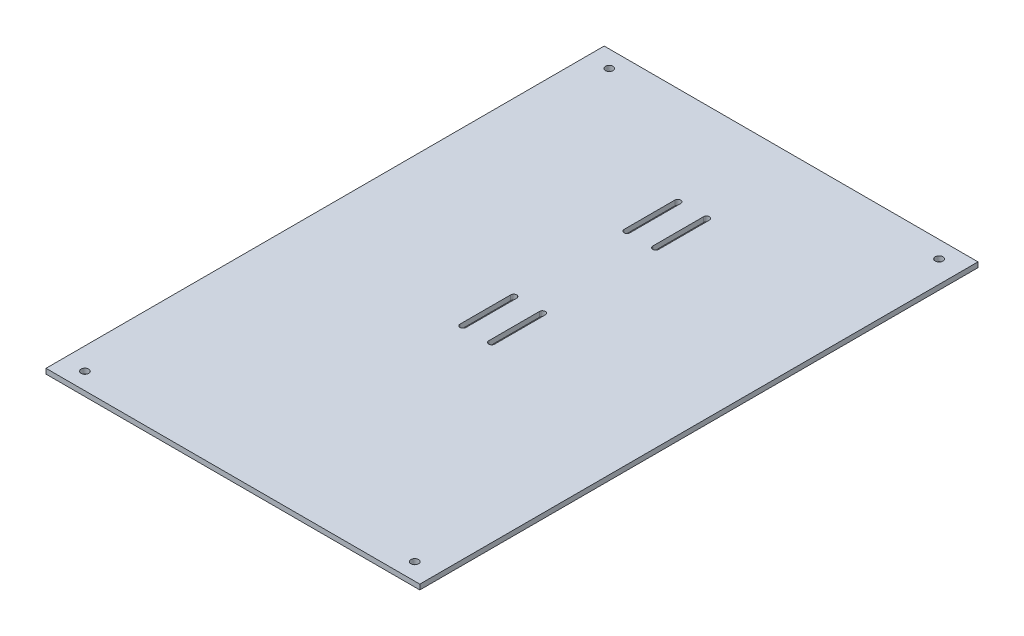
ISO-10303-21;
HEADER;
FILE_DESCRIPTION(('STEP AP214'),'2;1');
FILE_NAME('part.step','',(''),(''),'','','');
FILE_SCHEMA(('AUTOMOTIVE_DESIGN { 1 0 10303 214 1 1 1 1 }'));
ENDSEC;
DATA;
#1=APPLICATION_CONTEXT('core data for automotive mechanical design processes');
#2=APPLICATION_PROTOCOL_DEFINITION('international standard','automotive_design',2000,#1);
#3=PRODUCT_CONTEXT('',#1,'mechanical');
#4=PRODUCT('Part','Part','',(#3));
#5=PRODUCT_RELATED_PRODUCT_CATEGORY('part','',(#4));
#6=PRODUCT_DEFINITION_FORMATION('','',#4);
#7=PRODUCT_DEFINITION_CONTEXT('part definition',#1,'design');
#8=PRODUCT_DEFINITION('design','',#6,#7);
#9=PRODUCT_DEFINITION_SHAPE('','',#8);
#10=(LENGTH_UNIT() NAMED_UNIT(*) SI_UNIT(.MILLI.,.METRE.));
#11=(NAMED_UNIT(*) PLANE_ANGLE_UNIT() SI_UNIT($,.RADIAN.));
#12=(NAMED_UNIT(*) SI_UNIT($,.STERADIAN.) SOLID_ANGLE_UNIT());
#13=UNCERTAINTY_MEASURE_WITH_UNIT(LENGTH_MEASURE(1.E-05),#10,'distance_accuracy_value','');
#14=(GEOMETRIC_REPRESENTATION_CONTEXT(3) GLOBAL_UNCERTAINTY_ASSIGNED_CONTEXT((#13)) GLOBAL_UNIT_ASSIGNED_CONTEXT((#10,
#11,#12)) REPRESENTATION_CONTEXT('',''));
#15=CARTESIAN_POINT('',(0.,0.,0.));
#16=DIRECTION('',(0.,0.,1.));
#17=DIRECTION('',(1.,0.,0.));
#18=AXIS2_PLACEMENT_3D('',#15,#16,#17);
#19=CARTESIAN_POINT('',(110.5,-13.,207.5));
#20=DIRECTION('',(0.,1.,0.));
#21=DIRECTION('',(0.,0.,1.));
#22=AXIS2_PLACEMENT_3D('',#19,#20,#21);
#23=PLANE('',#22);
#24=CARTESIAN_POINT('',(-97.5,-13.,197.5));
#25=DIRECTION('',(0.,-1.,0.));
#26=DIRECTION('',(0.,0.,-1.));
#27=AXIS2_PLACEMENT_3D('',#24,#25,#26);
#28=CIRCLE('',#27,2.24999999999999);
#29=CARTESIAN_POINT('',(-97.5,-13.,195.25));
#30=VERTEX_POINT('',#29);
#31=EDGE_CURVE('E374',#30,#30,#28,.T.);
#32=ORIENTED_EDGE('',*,*,#31,.F.);
#33=EDGE_LOOP('',(#32));
#34=FACE_BOUND('',#33,.T.);
#35=CARTESIAN_POINT('',(97.5,-13.,197.5));
#36=DIRECTION('',(0.,-1.,0.));
#37=DIRECTION('',(0.,0.,-1.));
#38=AXIS2_PLACEMENT_3D('',#35,#36,#37);
#39=CIRCLE('',#38,2.24999999999999);
#40=CARTESIAN_POINT('',(97.5,-13.,195.25));
#41=VERTEX_POINT('',#40);
#42=EDGE_CURVE('E378',#41,#41,#39,.T.);
#43=ORIENTED_EDGE('',*,*,#42,.F.);
#44=EDGE_LOOP('',(#43));
#45=FACE_BOUND('',#44,.T.);
#46=CARTESIAN_POINT('',(97.5,-13.,-112.5));
#47=DIRECTION('',(0.,-1.,0.));
#48=DIRECTION('',(0.,0.,-1.));
#49=AXIS2_PLACEMENT_3D('',#46,#47,#48);
#50=CIRCLE('',#49,2.24999999999999);
#51=CARTESIAN_POINT('',(97.5,-13.,-114.75));
#52=VERTEX_POINT('',#51);
#53=EDGE_CURVE('E382',#52,#52,#50,.T.);
#54=ORIENTED_EDGE('',*,*,#53,.F.);
#55=EDGE_LOOP('',(#54));
#56=FACE_BOUND('',#55,.T.);
#57=CARTESIAN_POINT('',(-97.5,-13.,-112.5));
#58=DIRECTION('',(0.,-1.,0.));
#59=DIRECTION('',(0.,0.,-1.));
#60=AXIS2_PLACEMENT_3D('',#57,#58,#59);
#61=CIRCLE('',#60,2.24999999999999);
#62=CARTESIAN_POINT('',(-97.5,-13.,-114.75));
#63=VERTEX_POINT('',#62);
#64=EDGE_CURVE('E386',#63,#63,#61,.T.);
#65=ORIENTED_EDGE('',*,*,#64,.F.);
#66=EDGE_LOOP('',(#65));
#67=FACE_BOUND('',#66,.T.);
#68=DIRECTION('',(0.,0.,-1.));
#69=VECTOR('',#68,1.);
#70=CARTESIAN_POINT('',(-10.7431705127637,-13.,62.5));
#71=LINE('',#70,#69);
#72=CARTESIAN_POINT('',(-10.7431705127637,-13.,62.5));
#73=VERTEX_POINT('',#72);
#74=CARTESIAN_POINT('',(-10.7431705127637,-13.,32.5));
#75=VERTEX_POINT('',#74);
#76=EDGE_CURVE('E201',#73,#75,#71,.T.);
#77=ORIENTED_EDGE('',*,*,#76,.F.);
#78=CARTESIAN_POINT('',(-8.9931705127637,-13.,62.5));
#79=DIRECTION('',(0.,-1.,0.));
#80=DIRECTION('',(0.,0.,-1.));
#81=AXIS2_PLACEMENT_3D('',#78,#79,#80);
#82=CIRCLE('',#81,1.75);
#83=CARTESIAN_POINT('',(-7.2431705127637,-13.,62.5));
#84=VERTEX_POINT('',#83);
#85=EDGE_CURVE('E56',#84,#73,#82,.T.);
#86=ORIENTED_EDGE('',*,*,#85,.F.);
#87=DIRECTION('',(0.,0.,1.));
#88=VECTOR('',#87,1.);
#89=CARTESIAN_POINT('',(-7.2431705127637,-13.,62.5));
#90=LINE('',#89,#88);
#91=CARTESIAN_POINT('',(-7.2431705127637,-13.,32.5));
#92=VERTEX_POINT('',#91);
#93=EDGE_CURVE('E194',#92,#84,#90,.T.);
#94=ORIENTED_EDGE('',*,*,#93,.F.);
#95=CARTESIAN_POINT('',(-8.9931705127637,-13.,32.5));
#96=DIRECTION('',(0.,-1.,0.));
#97=DIRECTION('',(0.,0.,-1.));
#98=AXIS2_PLACEMENT_3D('',#95,#96,#97);
#99=CIRCLE('',#98,1.75);
#100=EDGE_CURVE('E208',#75,#92,#99,.T.);
#101=ORIENTED_EDGE('',*,*,#100,.F.);
#102=EDGE_LOOP('',(#77,#86,#94,#101));
#103=FACE_BOUND('',#102,.T.);
#104=DIRECTION('',(0.,0.,-1.));
#105=VECTOR('',#104,1.);
#106=CARTESIAN_POINT('',(6.25682948723529,-13.,62.4999999999998));
#107=LINE('',#106,#105);
#108=CARTESIAN_POINT('',(6.25682948723529,-13.,62.4999999999998));
#109=VERTEX_POINT('',#108);
#110=CARTESIAN_POINT('',(6.25682948723529,-13.,32.4999999999998));
#111=VERTEX_POINT('',#110);
#112=EDGE_CURVE('E260',#109,#111,#107,.T.);
#113=ORIENTED_EDGE('',*,*,#112,.F.);
#114=CARTESIAN_POINT('',(8.00682948723529,-13.,62.4999999999998));
#115=DIRECTION('',(0.,-1.,0.));
#116=DIRECTION('',(0.,0.,-1.));
#117=AXIS2_PLACEMENT_3D('',#114,#115,#116);
#118=CIRCLE('',#117,1.74999999999999);
#119=CARTESIAN_POINT('',(9.75682948723527,-13.,62.4999999999998));
#120=VERTEX_POINT('',#119);
#121=EDGE_CURVE('E64',#120,#109,#118,.T.);
#122=ORIENTED_EDGE('',*,*,#121,.F.);
#123=DIRECTION('',(0.,0.,1.));
#124=VECTOR('',#123,1.);
#125=CARTESIAN_POINT('',(9.75682948723527,-13.,62.4999999999998));
#126=LINE('',#125,#124);
#127=CARTESIAN_POINT('',(9.75682948723527,-13.,32.4999999999998));
#128=VERTEX_POINT('',#127);
#129=EDGE_CURVE('E266',#128,#120,#126,.T.);
#130=ORIENTED_EDGE('',*,*,#129,.F.);
#131=CARTESIAN_POINT('',(8.00682948723529,-13.,32.4999999999998));
#132=DIRECTION('',(0.,-1.,0.));
#133=DIRECTION('',(0.,0.,-1.));
#134=AXIS2_PLACEMENT_3D('',#131,#132,#133);
#135=CIRCLE('',#134,1.74999999999999);
#136=EDGE_CURVE('E263',#111,#128,#135,.T.);
#137=ORIENTED_EDGE('',*,*,#136,.F.);
#138=EDGE_LOOP('',(#113,#122,#130,#137));
#139=FACE_BOUND('',#138,.T.);
#140=DIRECTION('',(0.,0.,-1.));
#141=VECTOR('',#140,1.);
#142=CARTESIAN_POINT('',(6.25682948723529,-13.,-34.5000000000001));
#143=LINE('',#142,#141);
#144=CARTESIAN_POINT('',(6.25682948723529,-13.,-34.5000000000001));
#145=VERTEX_POINT('',#144);
#146=CARTESIAN_POINT('',(6.2568294872353,-13.,-64.5000000000001));
#147=VERTEX_POINT('',#146);
#148=EDGE_CURVE('E229',#145,#147,#143,.T.);
#149=ORIENTED_EDGE('',*,*,#148,.F.);
#150=CARTESIAN_POINT('',(8.00682948723529,-13.,-34.5000000000001));
#151=DIRECTION('',(0.,-1.,0.));
#152=DIRECTION('',(0.,0.,-1.));
#153=AXIS2_PLACEMENT_3D('',#150,#151,#152);
#154=CIRCLE('',#153,1.75);
#155=CARTESIAN_POINT('',(9.75682948723529,-13.,-34.5000000000001));
#156=VERTEX_POINT('',#155);
#157=EDGE_CURVE('E227',#156,#145,#154,.T.);
#158=ORIENTED_EDGE('',*,*,#157,.F.);
#159=DIRECTION('',(0.,0.,1.));
#160=VECTOR('',#159,1.);
#161=CARTESIAN_POINT('',(9.75682948723529,-13.,-34.5000000000001));
#162=LINE('',#161,#160);
#163=CARTESIAN_POINT('',(9.75682948723529,-13.,-64.5000000000001));
#164=VERTEX_POINT('',#163);
#165=EDGE_CURVE('E235',#164,#156,#162,.T.);
#166=ORIENTED_EDGE('',*,*,#165,.F.);
#167=CARTESIAN_POINT('',(8.0068294872353,-13.,-64.5000000000001));
#168=DIRECTION('',(0.,-1.,0.));
#169=DIRECTION('',(0.,0.,-1.));
#170=AXIS2_PLACEMENT_3D('',#167,#168,#169);
#171=CIRCLE('',#170,1.75);
#172=EDGE_CURVE('E232',#147,#164,#171,.T.);
#173=ORIENTED_EDGE('',*,*,#172,.F.);
#174=EDGE_LOOP('',(#149,#158,#166,#173));
#175=FACE_BOUND('',#174,.T.);
#176=DIRECTION('',(0.,0.,-1.));
#177=VECTOR('',#176,1.);
#178=CARTESIAN_POINT('',(-10.7431705127637,-13.,-34.4999999999999));
#179=LINE('',#178,#177);
#180=CARTESIAN_POINT('',(-10.7431705127637,-13.,-34.5));
#181=VERTEX_POINT('',#180);
#182=CARTESIAN_POINT('',(-10.7431705127637,-13.,-64.4999999999999));
#183=VERTEX_POINT('',#182);
#184=EDGE_CURVE('E289',#181,#183,#179,.T.);
#185=ORIENTED_EDGE('',*,*,#184,.F.);
#186=CARTESIAN_POINT('',(-8.9931705127637,-13.,-34.4999999999999));
#187=DIRECTION('',(0.,-1.,0.));
#188=DIRECTION('',(0.,0.,-1.));
#189=AXIS2_PLACEMENT_3D('',#186,#187,#188);
#190=CIRCLE('',#189,1.75);
#191=CARTESIAN_POINT('',(-7.2431705127637,-13.,-34.4999999999999));
#192=VERTEX_POINT('',#191);
#193=EDGE_CURVE('E287',#192,#181,#190,.T.);
#194=ORIENTED_EDGE('',*,*,#193,.F.);
#195=DIRECTION('',(0.,0.,1.));
#196=VECTOR('',#195,1.);
#197=CARTESIAN_POINT('',(-7.2431705127637,-13.,-34.4999999999999));
#198=LINE('',#197,#196);
#199=CARTESIAN_POINT('',(-7.2431705127637,-13.,-64.4999999999999));
#200=VERTEX_POINT('',#199);
#201=EDGE_CURVE('E295',#200,#192,#198,.T.);
#202=ORIENTED_EDGE('',*,*,#201,.F.);
#203=CARTESIAN_POINT('',(-8.9931705127637,-13.,-64.4999999999999));
#204=DIRECTION('',(0.,-1.,0.));
#205=DIRECTION('',(0.,0.,-1.));
#206=AXIS2_PLACEMENT_3D('',#203,#204,#205);
#207=CIRCLE('',#206,1.75);
#208=EDGE_CURVE('E292',#183,#200,#207,.T.);
#209=ORIENTED_EDGE('',*,*,#208,.F.);
#210=EDGE_LOOP('',(#185,#194,#202,#209));
#211=FACE_BOUND('',#210,.T.);
#212=DIRECTION('',(-1.,0.,0.));
#213=VECTOR('',#212,1.);
#214=CARTESIAN_POINT('',(110.5,-13.,207.5));
#215=LINE('',#214,#213);
#216=CARTESIAN_POINT('',(110.5,-13.,207.5));
#217=VERTEX_POINT('',#216);
#218=CARTESIAN_POINT('',(-110.5,-13.,207.5));
#219=VERTEX_POINT('',#218);
#220=EDGE_CURVE('E333',#217,#219,#215,.T.);
#221=ORIENTED_EDGE('',*,*,#220,.T.);
#222=DIRECTION('',(0.,0.,-1.));
#223=VECTOR('',#222,1.);
#224=CARTESIAN_POINT('',(-110.5,-13.,207.5));
#225=LINE('',#224,#223);
#226=CARTESIAN_POINT('',(-110.5,-13.,-122.5));
#227=VERTEX_POINT('',#226);
#228=EDGE_CURVE('E310',#219,#227,#225,.T.);
#229=ORIENTED_EDGE('',*,*,#228,.T.);
#230=DIRECTION('',(-1.,0.,0.));
#231=VECTOR('',#230,1.);
#232=CARTESIAN_POINT('',(110.5,-13.,-122.5));
#233=LINE('',#232,#231);
#234=CARTESIAN_POINT('',(110.5,-13.,-122.5));
#235=VERTEX_POINT('',#234);
#236=EDGE_CURVE('E11',#235,#227,#233,.T.);
#237=ORIENTED_EDGE('',*,*,#236,.F.);
#238=DIRECTION('',(0.,0.,-1.));
#239=VECTOR('',#238,1.);
#240=CARTESIAN_POINT('',(110.5,-13.,207.5));
#241=LINE('',#240,#239);
#242=EDGE_CURVE('E322',#217,#235,#241,.T.);
#243=ORIENTED_EDGE('',*,*,#242,.F.);
#244=EDGE_LOOP('',(#221,#229,#237,#243));
#245=FACE_BOUND('',#244,.T.);
#246=ADVANCED_FACE('F42',(#34,#45,#56,#67,#103,#139,#175,#211,#245),#23,.F.);
#247=CARTESIAN_POINT('',(110.5,-10.,-122.5));
#248=DIRECTION('',(0.,0.,-1.));
#249=DIRECTION('',(0.,1.,0.));
#250=AXIS2_PLACEMENT_3D('',#247,#248,#249);
#251=PLANE('',#250);
#252=ORIENTED_EDGE('',*,*,#236,.T.);
#253=DIRECTION('',(0.,-1.,0.));
#254=VECTOR('',#253,1.);
#255=CARTESIAN_POINT('',(-110.5,-10.,-122.5));
#256=LINE('',#255,#254);
#257=CARTESIAN_POINT('',(-110.5,-10.,-122.5));
#258=VERTEX_POINT('',#257);
#259=EDGE_CURVE('E313',#258,#227,#256,.T.);
#260=ORIENTED_EDGE('',*,*,#259,.F.);
#261=DIRECTION('',(-1.,0.,0.));
#262=VECTOR('',#261,1.);
#263=CARTESIAN_POINT('',(110.5,-10.,-122.5));
#264=LINE('',#263,#262);
#265=CARTESIAN_POINT('',(110.5,-10.,-122.5));
#266=VERTEX_POINT('',#265);
#267=EDGE_CURVE('E49',#266,#258,#264,.T.);
#268=ORIENTED_EDGE('',*,*,#267,.F.);
#269=DIRECTION('',(0.,-1.,0.));
#270=VECTOR('',#269,1.);
#271=CARTESIAN_POINT('',(110.5,-10.,-122.5));
#272=LINE('',#271,#270);
#273=EDGE_CURVE('E324',#266,#235,#272,.T.);
#274=ORIENTED_EDGE('',*,*,#273,.T.);
#275=EDGE_LOOP('',(#252,#260,#268,#274));
#276=FACE_BOUND('',#275,.T.);
#277=ADVANCED_FACE('F346',(#276),#251,.T.);
#278=CARTESIAN_POINT('',(110.5,-10.,207.5));
#279=DIRECTION('',(0.,1.,0.));
#280=DIRECTION('',(0.,0.,1.));
#281=AXIS2_PLACEMENT_3D('',#278,#279,#280);
#282=PLANE('',#281);
#283=CARTESIAN_POINT('',(-97.5,-10.,197.5));
#284=DIRECTION('',(0.,-1.,0.));
#285=DIRECTION('',(0.,0.,-1.));
#286=AXIS2_PLACEMENT_3D('',#283,#284,#285);
#287=CIRCLE('',#286,2.25);
#288=CARTESIAN_POINT('',(-97.5,-10.,195.25));
#289=VERTEX_POINT('',#288);
#290=EDGE_CURVE('E675',#289,#289,#287,.T.);
#291=ORIENTED_EDGE('',*,*,#290,.T.);
#292=EDGE_LOOP('',(#291));
#293=FACE_BOUND('',#292,.T.);
#294=CARTESIAN_POINT('',(97.5,-10.,197.5));
#295=DIRECTION('',(0.,-1.,0.));
#296=DIRECTION('',(0.,0.,-1.));
#297=AXIS2_PLACEMENT_3D('',#294,#295,#296);
#298=CIRCLE('',#297,2.25);
#299=CARTESIAN_POINT('',(97.5,-10.,195.25));
#300=VERTEX_POINT('',#299);
#301=EDGE_CURVE('E679',#300,#300,#298,.T.);
#302=ORIENTED_EDGE('',*,*,#301,.T.);
#303=EDGE_LOOP('',(#302));
#304=FACE_BOUND('',#303,.T.);
#305=CARTESIAN_POINT('',(97.5,-10.,-112.5));
#306=DIRECTION('',(0.,-1.,0.));
#307=DIRECTION('',(0.,0.,-1.));
#308=AXIS2_PLACEMENT_3D('',#305,#306,#307);
#309=CIRCLE('',#308,2.25);
#310=CARTESIAN_POINT('',(97.5,-10.,-114.75));
#311=VERTEX_POINT('',#310);
#312=EDGE_CURVE('E683',#311,#311,#309,.T.);
#313=ORIENTED_EDGE('',*,*,#312,.T.);
#314=EDGE_LOOP('',(#313));
#315=FACE_BOUND('',#314,.T.);
#316=CARTESIAN_POINT('',(-97.5,-10.,-112.5));
#317=DIRECTION('',(0.,-1.,0.));
#318=DIRECTION('',(0.,0.,-1.));
#319=AXIS2_PLACEMENT_3D('',#316,#317,#318);
#320=CIRCLE('',#319,2.25);
#321=CARTESIAN_POINT('',(-97.5,-10.,-114.75));
#322=VERTEX_POINT('',#321);
#323=EDGE_CURVE('E686',#322,#322,#320,.T.);
#324=ORIENTED_EDGE('',*,*,#323,.T.);
#325=EDGE_LOOP('',(#324));
#326=FACE_BOUND('',#325,.T.);
#327=CARTESIAN_POINT('',(-8.9931705127637,-10.,62.5));
#328=DIRECTION('',(0.,1.,0.));
#329=DIRECTION('',(0.,0.,1.));
#330=AXIS2_PLACEMENT_3D('',#327,#328,#329);
#331=CIRCLE('',#330,1.75);
#332=CARTESIAN_POINT('',(-7.2431705127637,-10.,62.5));
#333=VERTEX_POINT('',#332);
#334=CARTESIAN_POINT('',(-10.7431705127637,-10.,62.5));
#335=VERTEX_POINT('',#334);
#336=EDGE_CURVE('E192',#333,#335,#331,.F.);
#337=ORIENTED_EDGE('',*,*,#336,.T.);
#338=DIRECTION('',(0.,0.,-1.));
#339=VECTOR('',#338,1.);
#340=CARTESIAN_POINT('',(-10.7431705127637,-10.,62.5));
#341=LINE('',#340,#339);
#342=CARTESIAN_POINT('',(-10.7431705127637,-10.,32.5));
#343=VERTEX_POINT('',#342);
#344=EDGE_CURVE('E178',#335,#343,#341,.T.);
#345=ORIENTED_EDGE('',*,*,#344,.T.);
#346=CARTESIAN_POINT('',(-8.9931705127637,-10.,32.5));
#347=DIRECTION('',(0.,1.,0.));
#348=DIRECTION('',(0.,0.,1.));
#349=AXIS2_PLACEMENT_3D('',#346,#347,#348);
#350=CIRCLE('',#349,1.75);
#351=CARTESIAN_POINT('',(-7.2431705127637,-10.,32.5));
#352=VERTEX_POINT('',#351);
#353=EDGE_CURVE('E203',#343,#352,#350,.F.);
#354=ORIENTED_EDGE('',*,*,#353,.T.);
#355=DIRECTION('',(0.,0.,1.));
#356=VECTOR('',#355,1.);
#357=CARTESIAN_POINT('',(-7.2431705127637,-10.,62.5));
#358=LINE('',#357,#356);
#359=EDGE_CURVE('E199',#352,#333,#358,.T.);
#360=ORIENTED_EDGE('',*,*,#359,.T.);
#361=EDGE_LOOP('',(#337,#345,#354,#360));
#362=FACE_BOUND('',#361,.T.);
#363=CARTESIAN_POINT('',(8.00682948723529,-10.,62.4999999999998));
#364=DIRECTION('',(0.,1.,0.));
#365=DIRECTION('',(0.,0.,1.));
#366=AXIS2_PLACEMENT_3D('',#363,#364,#365);
#367=CIRCLE('',#366,1.74999999999999);
#368=CARTESIAN_POINT('',(9.75682948723527,-10.,62.4999999999998));
#369=VERTEX_POINT('',#368);
#370=CARTESIAN_POINT('',(6.25682948723529,-10.,62.4999999999998));
#371=VERTEX_POINT('',#370);
#372=EDGE_CURVE('E256',#369,#371,#367,.F.);
#373=ORIENTED_EDGE('',*,*,#372,.T.);
#374=DIRECTION('',(0.,0.,-1.));
#375=VECTOR('',#374,1.);
#376=CARTESIAN_POINT('',(6.25682948723529,-10.,62.4999999999998));
#377=LINE('',#376,#375);
#378=CARTESIAN_POINT('',(6.25682948723529,-10.,32.4999999999998));
#379=VERTEX_POINT('',#378);
#380=EDGE_CURVE('E221',#371,#379,#377,.T.);
#381=ORIENTED_EDGE('',*,*,#380,.T.);
#382=CARTESIAN_POINT('',(8.00682948723529,-10.,32.4999999999998));
#383=DIRECTION('',(0.,1.,0.));
#384=DIRECTION('',(0.,0.,1.));
#385=AXIS2_PLACEMENT_3D('',#382,#383,#384);
#386=CIRCLE('',#385,1.74999999999999);
#387=CARTESIAN_POINT('',(9.75682948723528,-10.,32.4999999999998));
#388=VERTEX_POINT('',#387);
#389=EDGE_CURVE('E188',#379,#388,#386,.F.);
#390=ORIENTED_EDGE('',*,*,#389,.T.);
#391=DIRECTION('',(0.,0.,1.));
#392=VECTOR('',#391,1.);
#393=CARTESIAN_POINT('',(9.75682948723527,-10.,62.4999999999998));
#394=LINE('',#393,#392);
#395=EDGE_CURVE('E253',#388,#369,#394,.T.);
#396=ORIENTED_EDGE('',*,*,#395,.T.);
#397=EDGE_LOOP('',(#373,#381,#390,#396));
#398=FACE_BOUND('',#397,.T.);
#399=CARTESIAN_POINT('',(8.00682948723529,-10.,-34.5000000000001));
#400=DIRECTION('',(0.,1.,0.));
#401=DIRECTION('',(0.,0.,1.));
#402=AXIS2_PLACEMENT_3D('',#399,#400,#401);
#403=CIRCLE('',#402,1.75);
#404=CARTESIAN_POINT('',(9.75682948723529,-10.,-34.5000000000001));
#405=VERTEX_POINT('',#404);
#406=CARTESIAN_POINT('',(6.25682948723529,-10.,-34.5000000000001));
#407=VERTEX_POINT('',#406);
#408=EDGE_CURVE('E224',#405,#407,#403,.F.);
#409=ORIENTED_EDGE('',*,*,#408,.T.);
#410=DIRECTION('',(0.,0.,-1.));
#411=VECTOR('',#410,1.);
#412=CARTESIAN_POINT('',(6.25682948723529,-10.,-34.5000000000001));
#413=LINE('',#412,#411);
#414=CARTESIAN_POINT('',(6.25682948723528,-10.,-64.5000000000001));
#415=VERTEX_POINT('',#414);
#416=EDGE_CURVE('E241',#407,#415,#413,.T.);
#417=ORIENTED_EDGE('',*,*,#416,.T.);
#418=CARTESIAN_POINT('',(8.0068294872353,-10.,-64.5000000000001));
#419=DIRECTION('',(0.,1.,0.));
#420=DIRECTION('',(0.,0.,1.));
#421=AXIS2_PLACEMENT_3D('',#418,#419,#420);
#422=CIRCLE('',#421,1.75);
#423=CARTESIAN_POINT('',(9.7568294872353,-10.,-64.5000000000001));
#424=VERTEX_POINT('',#423);
#425=EDGE_CURVE('E217',#415,#424,#422,.F.);
#426=ORIENTED_EDGE('',*,*,#425,.T.);
#427=DIRECTION('',(0.,0.,1.));
#428=VECTOR('',#427,1.);
#429=CARTESIAN_POINT('',(9.75682948723529,-10.,-34.5000000000001));
#430=LINE('',#429,#428);
#431=EDGE_CURVE('E220',#424,#405,#430,.T.);
#432=ORIENTED_EDGE('',*,*,#431,.T.);
#433=EDGE_LOOP('',(#409,#417,#426,#432));
#434=FACE_BOUND('',#433,.T.);
#435=CARTESIAN_POINT('',(-8.9931705127637,-10.,-34.4999999999999));
#436=DIRECTION('',(0.,1.,0.));
#437=DIRECTION('',(0.,0.,1.));
#438=AXIS2_PLACEMENT_3D('',#435,#436,#437);
#439=CIRCLE('',#438,1.75);
#440=CARTESIAN_POINT('',(-7.2431705127637,-10.,-34.4999999999999));
#441=VERTEX_POINT('',#440);
#442=CARTESIAN_POINT('',(-10.7431705127637,-10.,-34.4999999999999));
#443=VERTEX_POINT('',#442);
#444=EDGE_CURVE('E284',#441,#443,#439,.F.);
#445=ORIENTED_EDGE('',*,*,#444,.T.);
#446=DIRECTION('',(0.,0.,-1.));
#447=VECTOR('',#446,1.);
#448=CARTESIAN_POINT('',(-10.7431705127637,-10.,-34.4999999999999));
#449=LINE('',#448,#447);
#450=CARTESIAN_POINT('',(-10.7431705127637,-10.,-64.5));
#451=VERTEX_POINT('',#450);
#452=EDGE_CURVE('E301',#443,#451,#449,.T.);
#453=ORIENTED_EDGE('',*,*,#452,.T.);
#454=CARTESIAN_POINT('',(-8.9931705127637,-10.,-64.4999999999999));
#455=DIRECTION('',(0.,1.,0.));
#456=DIRECTION('',(0.,0.,1.));
#457=AXIS2_PLACEMENT_3D('',#454,#455,#456);
#458=CIRCLE('',#457,1.75);
#459=CARTESIAN_POINT('',(-7.2431705127637,-10.,-64.4999999999999));
#460=VERTEX_POINT('',#459);
#461=EDGE_CURVE('E250',#451,#460,#458,.F.);
#462=ORIENTED_EDGE('',*,*,#461,.T.);
#463=DIRECTION('',(0.,0.,1.));
#464=VECTOR('',#463,1.);
#465=CARTESIAN_POINT('',(-7.2431705127637,-10.,-34.4999999999999));
#466=LINE('',#465,#464);
#467=EDGE_CURVE('E281',#460,#441,#466,.T.);
#468=ORIENTED_EDGE('',*,*,#467,.T.);
#469=EDGE_LOOP('',(#445,#453,#462,#468));
#470=FACE_BOUND('',#469,.T.);
#471=ORIENTED_EDGE('',*,*,#267,.T.);
#472=DIRECTION('',(0.,0.,-1.));
#473=VECTOR('',#472,1.);
#474=CARTESIAN_POINT('',(-110.5,-10.,207.5));
#475=LINE('',#474,#473);
#476=CARTESIAN_POINT('',(-110.5,-10.,207.5));
#477=VERTEX_POINT('',#476);
#478=EDGE_CURVE('E316',#477,#258,#475,.T.);
#479=ORIENTED_EDGE('',*,*,#478,.F.);
#480=DIRECTION('',(-1.,0.,0.));
#481=VECTOR('',#480,1.);
#482=CARTESIAN_POINT('',(110.5,-10.,207.5));
#483=LINE('',#482,#481);
#484=CARTESIAN_POINT('',(110.5,-10.,207.5));
#485=VERTEX_POINT('',#484);
#486=EDGE_CURVE('E335',#485,#477,#483,.T.);
#487=ORIENTED_EDGE('',*,*,#486,.F.);
#488=DIRECTION('',(0.,0.,-1.));
#489=VECTOR('',#488,1.);
#490=CARTESIAN_POINT('',(110.5,-10.,207.5));
#491=LINE('',#490,#489);
#492=EDGE_CURVE('E327',#485,#266,#491,.T.);
#493=ORIENTED_EDGE('',*,*,#492,.T.);
#494=EDGE_LOOP('',(#471,#479,#487,#493));
#495=FACE_BOUND('',#494,.T.);
#496=ADVANCED_FACE('F197',(#293,#304,#315,#326,#362,#398,#434,#470,#495),#282,.T.);
#497=CARTESIAN_POINT('',(110.5,-13.,207.5));
#498=DIRECTION('',(0.,0.,1.));
#499=DIRECTION('',(1.,0.,0.));
#500=AXIS2_PLACEMENT_3D('',#497,#498,#499);
#501=PLANE('',#500);
#502=ORIENTED_EDGE('',*,*,#486,.T.);
#503=DIRECTION('',(0.,1.,0.));
#504=VECTOR('',#503,1.);
#505=CARTESIAN_POINT('',(-110.5,-13.,207.5));
#506=LINE('',#505,#504);
#507=EDGE_CURVE('E319',#219,#477,#506,.T.);
#508=ORIENTED_EDGE('',*,*,#507,.F.);
#509=ORIENTED_EDGE('',*,*,#220,.F.);
#510=DIRECTION('',(0.,1.,0.));
#511=VECTOR('',#510,1.);
#512=CARTESIAN_POINT('',(110.5,-13.,207.5));
#513=LINE('',#512,#511);
#514=EDGE_CURVE('E330',#217,#485,#513,.T.);
#515=ORIENTED_EDGE('',*,*,#514,.T.);
#516=EDGE_LOOP('',(#502,#508,#509,#515));
#517=FACE_BOUND('',#516,.T.);
#518=ADVANCED_FACE('F352',(#517),#501,.T.);
#519=CARTESIAN_POINT('',(110.5,0.,0.));
#520=DIRECTION('',(-1.,0.,0.));
#521=DIRECTION('',(0.,0.,1.));
#522=AXIS2_PLACEMENT_3D('',#519,#520,#521);
#523=PLANE('',#522);
#524=ORIENTED_EDGE('',*,*,#242,.T.);
#525=ORIENTED_EDGE('',*,*,#273,.F.);
#526=ORIENTED_EDGE('',*,*,#492,.F.);
#527=ORIENTED_EDGE('',*,*,#514,.F.);
#528=EDGE_LOOP('',(#524,#525,#526,#527));
#529=FACE_BOUND('',#528,.T.);
#530=ADVANCED_FACE('F354',(#529),#523,.F.);
#531=CARTESIAN_POINT('',(-110.5,0.,0.));
#532=DIRECTION('',(-1.,0.,0.));
#533=DIRECTION('',(0.,0.,1.));
#534=AXIS2_PLACEMENT_3D('',#531,#532,#533);
#535=PLANE('',#534);
#536=ORIENTED_EDGE('',*,*,#228,.F.);
#537=ORIENTED_EDGE('',*,*,#507,.T.);
#538=ORIENTED_EDGE('',*,*,#478,.T.);
#539=ORIENTED_EDGE('',*,*,#259,.T.);
#540=EDGE_LOOP('',(#536,#537,#538,#539));
#541=FACE_BOUND('',#540,.T.);
#542=ADVANCED_FACE('F344',(#541),#535,.T.);
#543=CARTESIAN_POINT('',(-8.9931705127637,-9.99900000000001,-34.4999999999999));
#544=DIRECTION('',(0.,-1.,0.));
#545=DIRECTION('',(0.,0.,-1.));
#546=AXIS2_PLACEMENT_3D('',#543,#544,#545);
#547=CYLINDRICAL_SURFACE('',#546,1.75);
#548=DIRECTION('',(0.,-1.,0.));
#549=VECTOR('',#548,1.);
#550=CARTESIAN_POINT('',(-7.2431705127637,-9.99900000000001,-34.4999999999999));
#551=LINE('',#550,#549);
#552=EDGE_CURVE('E299',#441,#192,#551,.T.);
#553=ORIENTED_EDGE('',*,*,#552,.T.);
#554=ORIENTED_EDGE('',*,*,#193,.T.);
#555=DIRECTION('',(0.,-1.,0.));
#556=VECTOR('',#555,1.);
#557=CARTESIAN_POINT('',(-10.7431705127637,-9.99900000000001,-34.4999999999999));
#558=LINE('',#557,#556);
#559=EDGE_CURVE('E298',#443,#181,#558,.T.);
#560=ORIENTED_EDGE('',*,*,#559,.F.);
#561=ORIENTED_EDGE('',*,*,#444,.F.);
#562=EDGE_LOOP('',(#553,#554,#560,#561));
#563=FACE_BOUND('',#562,.T.);
#564=ADVANCED_FACE('F361',(#563),#547,.F.);
#565=CARTESIAN_POINT('',(-7.2431705127637,-9.99900000000001,-34.4999999999999));
#566=DIRECTION('',(1.,0.,0.));
#567=DIRECTION('',(0.,0.,-1.));
#568=AXIS2_PLACEMENT_3D('',#565,#566,#567);
#569=PLANE('',#568);
#570=DIRECTION('',(0.,-1.,0.));
#571=VECTOR('',#570,1.);
#572=CARTESIAN_POINT('',(-7.2431705127637,-9.99900000000001,-64.4999999999999));
#573=LINE('',#572,#571);
#574=EDGE_CURVE('E302',#460,#200,#573,.T.);
#575=ORIENTED_EDGE('',*,*,#574,.T.);
#576=ORIENTED_EDGE('',*,*,#201,.T.);
#577=ORIENTED_EDGE('',*,*,#552,.F.);
#578=ORIENTED_EDGE('',*,*,#467,.F.);
#579=EDGE_LOOP('',(#575,#576,#577,#578));
#580=FACE_BOUND('',#579,.T.);
#581=ADVANCED_FACE('F409',(#580),#569,.F.);
#582=CARTESIAN_POINT('',(-8.9931705127637,-9.99900000000001,-64.4999999999999));
#583=DIRECTION('',(0.,-1.,0.));
#584=DIRECTION('',(0.,0.,-1.));
#585=AXIS2_PLACEMENT_3D('',#582,#583,#584);
#586=CYLINDRICAL_SURFACE('',#585,1.75);
#587=DIRECTION('',(0.,-1.,0.));
#588=VECTOR('',#587,1.);
#589=CARTESIAN_POINT('',(-10.7431705127637,-9.99900000000001,-64.4999999999999));
#590=LINE('',#589,#588);
#591=EDGE_CURVE('E304',#451,#183,#590,.T.);
#592=ORIENTED_EDGE('',*,*,#591,.T.);
#593=ORIENTED_EDGE('',*,*,#208,.T.);
#594=ORIENTED_EDGE('',*,*,#574,.F.);
#595=ORIENTED_EDGE('',*,*,#461,.F.);
#596=EDGE_LOOP('',(#592,#593,#594,#595));
#597=FACE_BOUND('',#596,.T.);
#598=ADVANCED_FACE('F411',(#597),#586,.F.);
#599=CARTESIAN_POINT('',(-10.7431705127637,-9.99900000000001,-34.4999999999999));
#600=DIRECTION('',(-1.,0.,0.));
#601=DIRECTION('',(0.,0.,1.));
#602=AXIS2_PLACEMENT_3D('',#599,#600,#601);
#603=PLANE('',#602);
#604=ORIENTED_EDGE('',*,*,#559,.T.);
#605=ORIENTED_EDGE('',*,*,#184,.T.);
#606=ORIENTED_EDGE('',*,*,#591,.F.);
#607=ORIENTED_EDGE('',*,*,#452,.F.);
#608=EDGE_LOOP('',(#604,#605,#606,#607));
#609=FACE_BOUND('',#608,.T.);
#610=ADVANCED_FACE('F401',(#609),#603,.F.);
#611=CARTESIAN_POINT('',(8.00682948723529,-9.99900000000001,-34.5000000000001));
#612=DIRECTION('',(0.,-1.,0.));
#613=DIRECTION('',(0.,0.,-1.));
#614=AXIS2_PLACEMENT_3D('',#611,#612,#613);
#615=CYLINDRICAL_SURFACE('',#614,1.75);
#616=DIRECTION('',(0.,-1.,0.));
#617=VECTOR('',#616,1.);
#618=CARTESIAN_POINT('',(9.75682948723529,-9.99900000000001,-34.5000000000001));
#619=LINE('',#618,#617);
#620=EDGE_CURVE('E239',#405,#156,#619,.T.);
#621=ORIENTED_EDGE('',*,*,#620,.T.);
#622=ORIENTED_EDGE('',*,*,#157,.T.);
#623=DIRECTION('',(0.,-1.,0.));
#624=VECTOR('',#623,1.);
#625=CARTESIAN_POINT('',(6.25682948723529,-9.99900000000001,-34.5000000000001));
#626=LINE('',#625,#624);
#627=EDGE_CURVE('E238',#407,#145,#626,.T.);
#628=ORIENTED_EDGE('',*,*,#627,.F.);
#629=ORIENTED_EDGE('',*,*,#408,.F.);
#630=EDGE_LOOP('',(#621,#622,#628,#629));
#631=FACE_BOUND('',#630,.T.);
#632=ADVANCED_FACE('F418',(#631),#615,.F.);
#633=CARTESIAN_POINT('',(9.75682948723529,-9.99900000000001,-34.5000000000001));
#634=DIRECTION('',(1.,0.,0.));
#635=DIRECTION('',(0.,0.,-1.));
#636=AXIS2_PLACEMENT_3D('',#633,#634,#635);
#637=PLANE('',#636);
#638=DIRECTION('',(0.,-1.,0.));
#639=VECTOR('',#638,1.);
#640=CARTESIAN_POINT('',(9.75682948723529,-9.99900000000001,-64.5000000000001));
#641=LINE('',#640,#639);
#642=EDGE_CURVE('E242',#424,#164,#641,.T.);
#643=ORIENTED_EDGE('',*,*,#642,.T.);
#644=ORIENTED_EDGE('',*,*,#165,.T.);
#645=ORIENTED_EDGE('',*,*,#620,.F.);
#646=ORIENTED_EDGE('',*,*,#431,.F.);
#647=EDGE_LOOP('',(#643,#644,#645,#646));
#648=FACE_BOUND('',#647,.T.);
#649=ADVANCED_FACE('F454',(#648),#637,.F.);
#650=CARTESIAN_POINT('',(8.0068294872353,-9.99900000000001,-64.5000000000001));
#651=DIRECTION('',(0.,-1.,0.));
#652=DIRECTION('',(0.,0.,-1.));
#653=AXIS2_PLACEMENT_3D('',#650,#651,#652);
#654=CYLINDRICAL_SURFACE('',#653,1.75);
#655=DIRECTION('',(0.,-1.,0.));
#656=VECTOR('',#655,1.);
#657=CARTESIAN_POINT('',(6.2568294872353,-9.99900000000001,-64.5000000000001));
#658=LINE('',#657,#656);
#659=EDGE_CURVE('E244',#415,#147,#658,.T.);
#660=ORIENTED_EDGE('',*,*,#659,.T.);
#661=ORIENTED_EDGE('',*,*,#172,.T.);
#662=ORIENTED_EDGE('',*,*,#642,.F.);
#663=ORIENTED_EDGE('',*,*,#425,.F.);
#664=EDGE_LOOP('',(#660,#661,#662,#663));
#665=FACE_BOUND('',#664,.T.);
#666=ADVANCED_FACE('F465',(#665),#654,.F.);
#667=CARTESIAN_POINT('',(6.25682948723529,-9.99900000000001,-34.5000000000001));
#668=DIRECTION('',(-1.,0.,0.));
#669=DIRECTION('',(0.,0.,1.));
#670=AXIS2_PLACEMENT_3D('',#667,#668,#669);
#671=PLANE('',#670);
#672=ORIENTED_EDGE('',*,*,#627,.T.);
#673=ORIENTED_EDGE('',*,*,#148,.T.);
#674=ORIENTED_EDGE('',*,*,#659,.F.);
#675=ORIENTED_EDGE('',*,*,#416,.F.);
#676=EDGE_LOOP('',(#672,#673,#674,#675));
#677=FACE_BOUND('',#676,.T.);
#678=ADVANCED_FACE('F476',(#677),#671,.F.);
#679=CARTESIAN_POINT('',(8.00682948723529,-9.99900000000001,62.4999999999998));
#680=DIRECTION('',(0.,-1.,0.));
#681=DIRECTION('',(0.,0.,-1.));
#682=AXIS2_PLACEMENT_3D('',#679,#680,#681);
#683=CYLINDRICAL_SURFACE('',#682,1.74999999999999);
#684=DIRECTION('',(0.,-1.,0.));
#685=VECTOR('',#684,1.);
#686=CARTESIAN_POINT('',(9.75682948723527,-9.99900000000001,62.4999999999998));
#687=LINE('',#686,#685);
#688=EDGE_CURVE('E270',#369,#120,#687,.T.);
#689=ORIENTED_EDGE('',*,*,#688,.T.);
#690=ORIENTED_EDGE('',*,*,#121,.T.);
#691=DIRECTION('',(0.,-1.,0.));
#692=VECTOR('',#691,1.);
#693=CARTESIAN_POINT('',(6.25682948723529,-9.99900000000001,62.4999999999998));
#694=LINE('',#693,#692);
#695=EDGE_CURVE('E269',#371,#109,#694,.T.);
#696=ORIENTED_EDGE('',*,*,#695,.F.);
#697=ORIENTED_EDGE('',*,*,#372,.F.);
#698=EDGE_LOOP('',(#689,#690,#696,#697));
#699=FACE_BOUND('',#698,.T.);
#700=ADVANCED_FACE('F487',(#699),#683,.F.);
#701=CARTESIAN_POINT('',(9.75682948723527,-9.99900000000001,62.4999999999998));
#702=DIRECTION('',(1.,0.,0.));
#703=DIRECTION('',(0.,0.,-1.));
#704=AXIS2_PLACEMENT_3D('',#701,#702,#703);
#705=PLANE('',#704);
#706=DIRECTION('',(0.,-1.,0.));
#707=VECTOR('',#706,1.);
#708=CARTESIAN_POINT('',(9.75682948723527,-9.99900000000001,32.4999999999998));
#709=LINE('',#708,#707);
#710=EDGE_CURVE('E272',#388,#128,#709,.T.);
#711=ORIENTED_EDGE('',*,*,#710,.T.);
#712=ORIENTED_EDGE('',*,*,#129,.T.);
#713=ORIENTED_EDGE('',*,*,#688,.F.);
#714=ORIENTED_EDGE('',*,*,#395,.F.);
#715=EDGE_LOOP('',(#711,#712,#713,#714));
#716=FACE_BOUND('',#715,.T.);
#717=ADVANCED_FACE('F498',(#716),#705,.F.);
#718=CARTESIAN_POINT('',(8.00682948723529,-9.99900000000001,32.4999999999998));
#719=DIRECTION('',(0.,-1.,0.));
#720=DIRECTION('',(0.,0.,-1.));
#721=AXIS2_PLACEMENT_3D('',#718,#719,#720);
#722=CYLINDRICAL_SURFACE('',#721,1.74999999999999);
#723=DIRECTION('',(0.,-1.,0.));
#724=VECTOR('',#723,1.);
#725=CARTESIAN_POINT('',(6.25682948723529,-9.99900000000001,32.4999999999998));
#726=LINE('',#725,#724);
#727=EDGE_CURVE('E274',#379,#111,#726,.T.);
#728=ORIENTED_EDGE('',*,*,#727,.T.);
#729=ORIENTED_EDGE('',*,*,#136,.T.);
#730=ORIENTED_EDGE('',*,*,#710,.F.);
#731=ORIENTED_EDGE('',*,*,#389,.F.);
#732=EDGE_LOOP('',(#728,#729,#730,#731));
#733=FACE_BOUND('',#732,.T.);
#734=ADVANCED_FACE('F507',(#733),#722,.F.);
#735=CARTESIAN_POINT('',(6.25682948723529,-9.99900000000001,62.4999999999998));
#736=DIRECTION('',(-1.,0.,0.));
#737=DIRECTION('',(0.,0.,1.));
#738=AXIS2_PLACEMENT_3D('',#735,#736,#737);
#739=PLANE('',#738);
#740=ORIENTED_EDGE('',*,*,#695,.T.);
#741=ORIENTED_EDGE('',*,*,#112,.T.);
#742=ORIENTED_EDGE('',*,*,#727,.F.);
#743=ORIENTED_EDGE('',*,*,#380,.F.);
#744=EDGE_LOOP('',(#740,#741,#742,#743));
#745=FACE_BOUND('',#744,.T.);
#746=ADVANCED_FACE('F518',(#745),#739,.F.);
#747=CARTESIAN_POINT('',(-8.9931705127637,-9.99900000000001,62.5));
#748=DIRECTION('',(0.,-1.,0.));
#749=DIRECTION('',(0.,0.,-1.));
#750=AXIS2_PLACEMENT_3D('',#747,#748,#749);
#751=CYLINDRICAL_SURFACE('',#750,1.75);
#752=DIRECTION('',(0.,-1.,0.));
#753=VECTOR('',#752,1.);
#754=CARTESIAN_POINT('',(-7.2431705127637,-9.99900000000001,62.5));
#755=LINE('',#754,#753);
#756=EDGE_CURVE('E189',#333,#84,#755,.T.);
#757=ORIENTED_EDGE('',*,*,#756,.T.);
#758=ORIENTED_EDGE('',*,*,#85,.T.);
#759=DIRECTION('',(0.,-1.,0.));
#760=VECTOR('',#759,1.);
#761=CARTESIAN_POINT('',(-10.7431705127637,-9.99900000000001,62.5));
#762=LINE('',#761,#760);
#763=EDGE_CURVE('E181',#335,#73,#762,.T.);
#764=ORIENTED_EDGE('',*,*,#763,.F.);
#765=ORIENTED_EDGE('',*,*,#336,.F.);
#766=EDGE_LOOP('',(#757,#758,#764,#765));
#767=FACE_BOUND('',#766,.T.);
#768=ADVANCED_FACE('F191',(#767),#751,.F.);
#769=CARTESIAN_POINT('',(-7.2431705127637,-9.99900000000001,62.5));
#770=DIRECTION('',(1.,0.,0.));
#771=DIRECTION('',(0.,0.,-1.));
#772=AXIS2_PLACEMENT_3D('',#769,#770,#771);
#773=PLANE('',#772);
#774=DIRECTION('',(0.,-1.,0.));
#775=VECTOR('',#774,1.);
#776=CARTESIAN_POINT('',(-7.2431705127637,-9.99900000000001,32.5));
#777=LINE('',#776,#775);
#778=EDGE_CURVE('E214',#352,#92,#777,.T.);
#779=ORIENTED_EDGE('',*,*,#778,.T.);
#780=ORIENTED_EDGE('',*,*,#93,.T.);
#781=ORIENTED_EDGE('',*,*,#756,.F.);
#782=ORIENTED_EDGE('',*,*,#359,.F.);
#783=EDGE_LOOP('',(#779,#780,#781,#782));
#784=FACE_BOUND('',#783,.T.);
#785=ADVANCED_FACE('F539',(#784),#773,.F.);
#786=CARTESIAN_POINT('',(-8.9931705127637,-9.99900000000001,32.5));
#787=DIRECTION('',(0.,-1.,0.));
#788=DIRECTION('',(0.,0.,-1.));
#789=AXIS2_PLACEMENT_3D('',#786,#787,#788);
#790=CYLINDRICAL_SURFACE('',#789,1.75);
#791=DIRECTION('',(0.,-1.,0.));
#792=VECTOR('',#791,1.);
#793=CARTESIAN_POINT('',(-10.7431705127637,-9.99900000000001,32.5));
#794=LINE('',#793,#792);
#795=EDGE_CURVE('E183',#343,#75,#794,.T.);
#796=ORIENTED_EDGE('',*,*,#795,.T.);
#797=ORIENTED_EDGE('',*,*,#100,.T.);
#798=ORIENTED_EDGE('',*,*,#778,.F.);
#799=ORIENTED_EDGE('',*,*,#353,.F.);
#800=EDGE_LOOP('',(#796,#797,#798,#799));
#801=FACE_BOUND('',#800,.T.);
#802=ADVANCED_FACE('F549',(#801),#790,.F.);
#803=CARTESIAN_POINT('',(-10.7431705127637,-9.99900000000001,62.5));
#804=DIRECTION('',(-1.,0.,0.));
#805=DIRECTION('',(0.,0.,1.));
#806=AXIS2_PLACEMENT_3D('',#803,#804,#805);
#807=PLANE('',#806);
#808=ORIENTED_EDGE('',*,*,#763,.T.);
#809=ORIENTED_EDGE('',*,*,#76,.T.);
#810=ORIENTED_EDGE('',*,*,#795,.F.);
#811=ORIENTED_EDGE('',*,*,#344,.F.);
#812=EDGE_LOOP('',(#808,#809,#810,#811));
#813=FACE_BOUND('',#812,.T.);
#814=ADVANCED_FACE('F179',(#813),#807,.F.);
#815=CARTESIAN_POINT('',(-97.5,-13.,-112.5));
#816=DIRECTION('',(0.,-1.,0.));
#817=DIRECTION('',(0.,0.,-1.));
#818=AXIS2_PLACEMENT_3D('',#815,#816,#817);
#819=CYLINDRICAL_SURFACE('',#818,2.25);
#820=ORIENTED_EDGE('',*,*,#323,.F.);
#821=EDGE_LOOP('',(#820));
#822=FACE_BOUND('',#821,.T.);
#823=ORIENTED_EDGE('',*,*,#64,.T.);
#824=EDGE_LOOP('',(#823));
#825=FACE_BOUND('',#824,.T.);
#826=ADVANCED_FACE('F568',(#822,#825),#819,.F.);
#827=CARTESIAN_POINT('',(97.5,-13.,-112.5));
#828=DIRECTION('',(0.,-1.,0.));
#829=DIRECTION('',(0.,0.,-1.));
#830=AXIS2_PLACEMENT_3D('',#827,#828,#829);
#831=CYLINDRICAL_SURFACE('',#830,2.25);
#832=ORIENTED_EDGE('',*,*,#312,.F.);
#833=EDGE_LOOP('',(#832));
#834=FACE_BOUND('',#833,.T.);
#835=ORIENTED_EDGE('',*,*,#53,.T.);
#836=EDGE_LOOP('',(#835));
#837=FACE_BOUND('',#836,.T.);
#838=ADVANCED_FACE('F579',(#834,#837),#831,.F.);
#839=CARTESIAN_POINT('',(97.5,-13.,197.5));
#840=DIRECTION('',(0.,-1.,0.));
#841=DIRECTION('',(0.,0.,-1.));
#842=AXIS2_PLACEMENT_3D('',#839,#840,#841);
#843=CYLINDRICAL_SURFACE('',#842,2.25);
#844=ORIENTED_EDGE('',*,*,#301,.F.);
#845=EDGE_LOOP('',(#844));
#846=FACE_BOUND('',#845,.T.);
#847=ORIENTED_EDGE('',*,*,#42,.T.);
#848=EDGE_LOOP('',(#847));
#849=FACE_BOUND('',#848,.T.);
#850=ADVANCED_FACE('F586',(#846,#849),#843,.F.);
#851=CARTESIAN_POINT('',(-97.5,-13.,197.5));
#852=DIRECTION('',(0.,-1.,0.));
#853=DIRECTION('',(0.,0.,-1.));
#854=AXIS2_PLACEMENT_3D('',#851,#852,#853);
#855=CYLINDRICAL_SURFACE('',#854,2.25);
#856=ORIENTED_EDGE('',*,*,#290,.F.);
#857=EDGE_LOOP('',(#856));
#858=FACE_BOUND('',#857,.T.);
#859=ORIENTED_EDGE('',*,*,#31,.T.);
#860=EDGE_LOOP('',(#859));
#861=FACE_BOUND('',#860,.T.);
#862=ADVANCED_FACE('F594',(#858,#861),#855,.F.);
#863=CLOSED_SHELL('',(#246,#277,#496,#518,#530,#542,#564,#581,#598,#610,#632,#649,#666,#678,
#700,#717,#734,#746,#768,#785,#802,#814,#826,#838,#850,#862));
#864=MANIFOLD_SOLID_BREP('B2',#863);
#865=ADVANCED_BREP_SHAPE_REPRESENTATION('',(#18,#864),#14);
#866=SHAPE_DEFINITION_REPRESENTATION(#9,#865);
ENDSEC;
END-ISO-10303-21;
